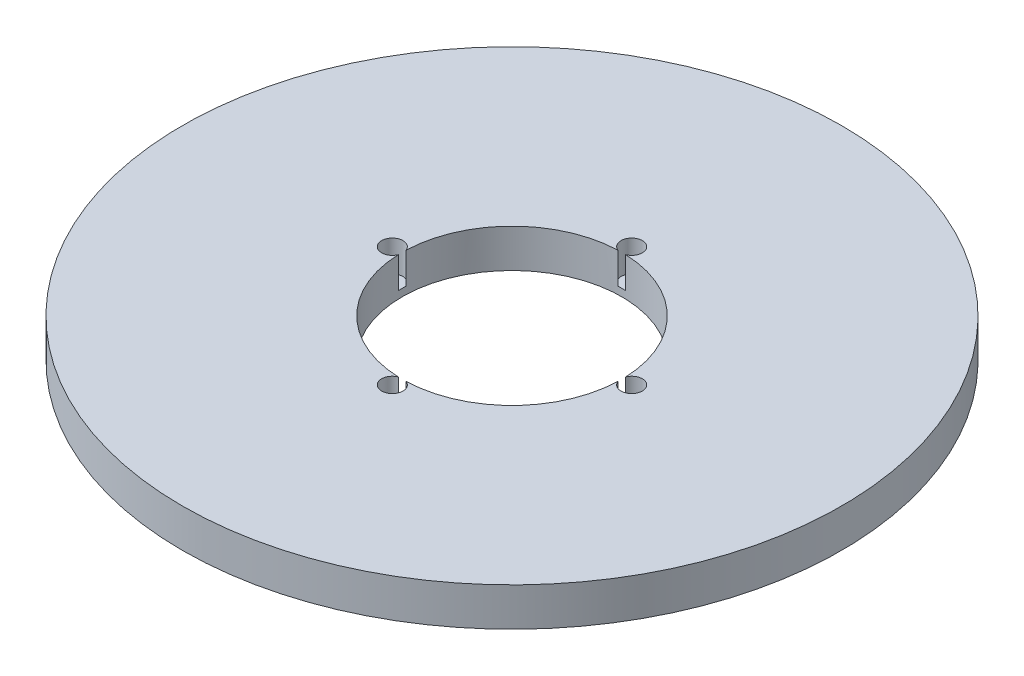
ISO-10303-21;
HEADER;
FILE_DESCRIPTION(('STEP AP214'),'2;1');
FILE_NAME('part.step','',(''),(''),'','','');
FILE_SCHEMA(('AUTOMOTIVE_DESIGN { 1 0 10303 214 1 1 1 1 }'));
ENDSEC;
DATA;
#1=APPLICATION_CONTEXT('core data for automotive mechanical design processes');
#2=APPLICATION_PROTOCOL_DEFINITION('international standard','automotive_design',2000,#1);
#3=PRODUCT_CONTEXT('',#1,'mechanical');
#4=PRODUCT('Part','Part','',(#3));
#5=PRODUCT_RELATED_PRODUCT_CATEGORY('part','',(#4));
#6=PRODUCT_DEFINITION_FORMATION('','',#4);
#7=PRODUCT_DEFINITION_CONTEXT('part definition',#1,'design');
#8=PRODUCT_DEFINITION('design','',#6,#7);
#9=PRODUCT_DEFINITION_SHAPE('','',#8);
#10=(LENGTH_UNIT() NAMED_UNIT(*) SI_UNIT(.MILLI.,.METRE.));
#11=(NAMED_UNIT(*) PLANE_ANGLE_UNIT() SI_UNIT($,.RADIAN.));
#12=(NAMED_UNIT(*) SI_UNIT($,.STERADIAN.) SOLID_ANGLE_UNIT());
#13=UNCERTAINTY_MEASURE_WITH_UNIT(LENGTH_MEASURE(1.E-05),#10,'distance_accuracy_value','');
#14=(GEOMETRIC_REPRESENTATION_CONTEXT(3) GLOBAL_UNCERTAINTY_ASSIGNED_CONTEXT((#13)) GLOBAL_UNIT_ASSIGNED_CONTEXT((#10,
#11,#12)) REPRESENTATION_CONTEXT('',''));
#15=CARTESIAN_POINT('',(0.,0.,0.));
#16=DIRECTION('',(0.,0.,1.));
#17=DIRECTION('',(1.,0.,0.));
#18=AXIS2_PLACEMENT_3D('',#15,#16,#17);
#19=CARTESIAN_POINT('',(0.,7.,0.));
#20=DIRECTION('',(0.,-1.,0.));
#21=DIRECTION('',(0.,0.,-1.));
#22=AXIS2_PLACEMENT_3D('',#19,#20,#21);
#23=CYLINDRICAL_SURFACE('',#22,60.);
#24=CARTESIAN_POINT('',(0.,7.,0.));
#25=DIRECTION('',(0.,1.,0.));
#26=DIRECTION('',(0.,0.,1.));
#27=AXIS2_PLACEMENT_3D('',#24,#25,#26);
#28=CIRCLE('',#27,60.);
#29=CARTESIAN_POINT('',(0.,7.,60.));
#30=VERTEX_POINT('',#29);
#31=EDGE_CURVE('E145',#30,#30,#28,.T.);
#32=ORIENTED_EDGE('',*,*,#31,.F.);
#33=EDGE_LOOP('',(#32));
#34=FACE_BOUND('',#33,.T.);
#35=CARTESIAN_POINT('',(0.,0.,0.));
#36=DIRECTION('',(0.,1.,0.));
#37=DIRECTION('',(0.,0.,1.));
#38=AXIS2_PLACEMENT_3D('',#35,#36,#37);
#39=CIRCLE('',#38,60.);
#40=CARTESIAN_POINT('',(0.,0.,60.));
#41=VERTEX_POINT('',#40);
#42=EDGE_CURVE('E143',#41,#41,#39,.T.);
#43=ORIENTED_EDGE('',*,*,#42,.T.);
#44=EDGE_LOOP('',(#43));
#45=FACE_BOUND('',#44,.T.);
#46=ADVANCED_FACE('F39',(#34,#45),#23,.T.);
#47=CARTESIAN_POINT('',(0.,7.,0.));
#48=DIRECTION('',(0.,1.,0.));
#49=DIRECTION('',(0.,0.,1.));
#50=AXIS2_PLACEMENT_3D('',#47,#48,#49);
#51=PLANE('',#50);
#52=CARTESIAN_POINT('',(0.,7.,21.7902012223669));
#53=DIRECTION('',(0.,1.,0.));
#54=DIRECTION('',(1.,0.,0.));
#55=AXIS2_PLACEMENT_3D('',#52,#53,#54);
#56=CIRCLE('',#55,1.9382259181155);
#57=CARTESIAN_POINT('',(-0.71161572601711,7.,19.9873360670822));
#58=VERTEX_POINT('',#57);
#59=CARTESIAN_POINT('',(0.711615726017248,7.,19.9873360670822));
#60=VERTEX_POINT('',#59);
#61=EDGE_CURVE('E152',#58,#60,#56,.T.);
#62=ORIENTED_EDGE('',*,*,#61,.F.);
#63=CARTESIAN_POINT('',(0.,7.,0.));
#64=DIRECTION('',(0.,1.,0.));
#65=DIRECTION('',(0.,0.,1.));
#66=AXIS2_PLACEMENT_3D('',#63,#64,#65);
#67=CIRCLE('',#66,20.);
#68=CARTESIAN_POINT('',(-19.9873360670822,7.,0.711615726017179));
#69=VERTEX_POINT('',#68);
#70=EDGE_CURVE('E133',#69,#58,#67,.T.);
#71=ORIENTED_EDGE('',*,*,#70,.F.);
#72=CARTESIAN_POINT('',(-21.7902012223669,7.,0.));
#73=DIRECTION('',(0.,1.,0.));
#74=DIRECTION('',(0.,0.,1.));
#75=AXIS2_PLACEMENT_3D('',#72,#73,#74);
#76=CIRCLE('',#75,1.9382259181155);
#77=CARTESIAN_POINT('',(-19.9873360670822,7.,-0.711615726017179));
#78=VERTEX_POINT('',#77);
#79=EDGE_CURVE('E128',#78,#69,#76,.T.);
#80=ORIENTED_EDGE('',*,*,#79,.F.);
#81=CARTESIAN_POINT('',(-0.711615726017389,7.,-19.9873360670822));
#82=VERTEX_POINT('',#81);
#83=EDGE_CURVE('E121',#82,#78,#67,.T.);
#84=ORIENTED_EDGE('',*,*,#83,.F.);
#85=CARTESIAN_POINT('',(-2.28240242812593E-13,7.,-21.7902012223669));
#86=DIRECTION('',(0.,1.,0.));
#87=DIRECTION('',(-1.,0.,0.));
#88=AXIS2_PLACEMENT_3D('',#85,#86,#87);
#89=CIRCLE('',#88,1.9382259181155);
#90=CARTESIAN_POINT('',(0.71161572601697,7.,-19.9873360670822));
#91=VERTEX_POINT('',#90);
#92=EDGE_CURVE('E105',#91,#82,#89,.T.);
#93=ORIENTED_EDGE('',*,*,#92,.F.);
#94=CARTESIAN_POINT('',(19.9873360670822,7.,-0.711615726017179));
#95=VERTEX_POINT('',#94);
#96=EDGE_CURVE('E131',#95,#91,#67,.T.);
#97=ORIENTED_EDGE('',*,*,#96,.F.);
#98=CARTESIAN_POINT('',(21.7902012223669,7.,0.));
#99=DIRECTION('',(0.,1.,0.));
#100=DIRECTION('',(0.,0.,-1.));
#101=AXIS2_PLACEMENT_3D('',#98,#99,#100);
#102=CIRCLE('',#101,1.9382259181155);
#103=CARTESIAN_POINT('',(19.9873360670822,7.,0.711615726017179));
#104=VERTEX_POINT('',#103);
#105=EDGE_CURVE('E154',#104,#95,#102,.T.);
#106=ORIENTED_EDGE('',*,*,#105,.F.);
#107=EDGE_CURVE('E134',#60,#104,#67,.T.);
#108=ORIENTED_EDGE('',*,*,#107,.F.);
#109=EDGE_LOOP('',(#62,#71,#80,#84,#93,#97,#106,#108));
#110=FACE_BOUND('',#109,.T.);
#111=ORIENTED_EDGE('',*,*,#31,.T.);
#112=EDGE_LOOP('',(#111));
#113=FACE_BOUND('',#112,.T.);
#114=ADVANCED_FACE('F130',(#110,#113),#51,.T.);
#115=CARTESIAN_POINT('',(0.,0.,0.));
#116=DIRECTION('',(0.,1.,0.));
#117=DIRECTION('',(0.,0.,1.));
#118=AXIS2_PLACEMENT_3D('',#115,#116,#117);
#119=PLANE('',#118);
#120=CARTESIAN_POINT('',(0.,0.,0.));
#121=DIRECTION('',(0.,1.,0.));
#122=DIRECTION('',(0.,0.,1.));
#123=AXIS2_PLACEMENT_3D('',#120,#121,#122);
#124=CIRCLE('',#123,20.);
#125=CARTESIAN_POINT('',(0.,0.,20.));
#126=VERTEX_POINT('',#125);
#127=EDGE_CURVE('E135',#126,#126,#124,.T.);
#128=ORIENTED_EDGE('',*,*,#127,.T.);
#129=EDGE_LOOP('',(#128));
#130=FACE_BOUND('',#129,.T.);
#131=ORIENTED_EDGE('',*,*,#42,.F.);
#132=EDGE_LOOP('',(#131));
#133=FACE_BOUND('',#132,.T.);
#134=ADVANCED_FACE('F195',(#130,#133),#119,.F.);
#135=CARTESIAN_POINT('',(0.,7.,0.));
#136=DIRECTION('',(0.,-1.,0.));
#137=DIRECTION('',(0.,0.,-1.));
#138=AXIS2_PLACEMENT_3D('',#135,#136,#137);
#139=CYLINDRICAL_SURFACE('',#138,20.);
#140=DIRECTION('',(0.,1.,0.));
#141=VECTOR('',#140,1.);
#142=CARTESIAN_POINT('',(-0.71161572601712,4.16236323519653,19.9873360670822));
#143=LINE('',#142,#141);
#144=CARTESIAN_POINT('',(-0.71161572601711,1.32472647039306,19.9873360670822));
#145=VERTEX_POINT('',#144);
#146=EDGE_CURVE('E11',#145,#58,#143,.T.);
#147=ORIENTED_EDGE('',*,*,#146,.F.);
#148=CARTESIAN_POINT('',(0.,1.32472647039306,0.));
#149=DIRECTION('',(0.,1.,0.));
#150=DIRECTION('',(0.,0.,1.));
#151=AXIS2_PLACEMENT_3D('',#148,#149,#150);
#152=CIRCLE('',#151,20.);
#153=CARTESIAN_POINT('',(0.711615726017248,1.32472647039306,19.9873360670822));
#154=VERTEX_POINT('',#153);
#155=EDGE_CURVE('E169',#145,#154,#152,.T.);
#156=ORIENTED_EDGE('',*,*,#155,.T.);
#157=DIRECTION('',(0.,1.,0.));
#158=VECTOR('',#157,1.);
#159=CARTESIAN_POINT('',(0.711615726017259,4.16236323519653,19.9873360670822));
#160=LINE('',#159,#158);
#161=EDGE_CURVE('E46',#60,#154,#160,.F.);
#162=ORIENTED_EDGE('',*,*,#161,.F.);
#163=ORIENTED_EDGE('',*,*,#107,.T.);
#164=DIRECTION('',(0.,1.,0.));
#165=VECTOR('',#164,1.);
#166=CARTESIAN_POINT('',(19.9873360670822,4.16236323519653,0.711615726017189));
#167=LINE('',#166,#165);
#168=CARTESIAN_POINT('',(19.9873360670822,1.32472647039306,0.711615726017179));
#169=VERTEX_POINT('',#168);
#170=EDGE_CURVE('E151',#169,#104,#167,.T.);
#171=ORIENTED_EDGE('',*,*,#170,.F.);
#172=CARTESIAN_POINT('',(0.,1.32472647039306,0.));
#173=DIRECTION('',(0.,1.,0.));
#174=DIRECTION('',(0.,0.,1.));
#175=AXIS2_PLACEMENT_3D('',#172,#173,#174);
#176=CIRCLE('',#175,20.);
#177=CARTESIAN_POINT('',(19.9873360670822,1.32472647039306,-0.711615726017179));
#178=VERTEX_POINT('',#177);
#179=EDGE_CURVE('E173',#169,#178,#176,.T.);
#180=ORIENTED_EDGE('',*,*,#179,.T.);
#181=DIRECTION('',(0.,1.,0.));
#182=VECTOR('',#181,1.);
#183=CARTESIAN_POINT('',(19.9873360670822,4.16236323519653,-0.711615726017189));
#184=LINE('',#183,#182);
#185=EDGE_CURVE('E168',#95,#178,#184,.F.);
#186=ORIENTED_EDGE('',*,*,#185,.F.);
#187=ORIENTED_EDGE('',*,*,#96,.T.);
#188=DIRECTION('',(0.,1.,0.));
#189=VECTOR('',#188,1.);
#190=CARTESIAN_POINT('',(0.71161572601698,4.16236323519653,-19.9873360670822));
#191=LINE('',#190,#189);
#192=CARTESIAN_POINT('',(0.71161572601697,1.32472647039306,-19.9873360670822));
#193=VERTEX_POINT('',#192);
#194=EDGE_CURVE('E108',#193,#91,#191,.T.);
#195=ORIENTED_EDGE('',*,*,#194,.F.);
#196=CARTESIAN_POINT('',(0.,1.32472647039306,0.));
#197=DIRECTION('',(0.,1.,0.));
#198=DIRECTION('',(0.,0.,1.));
#199=AXIS2_PLACEMENT_3D('',#196,#197,#198);
#200=CIRCLE('',#199,20.);
#201=CARTESIAN_POINT('',(-0.711615726017389,1.32472647039306,-19.9873360670822));
#202=VERTEX_POINT('',#201);
#203=EDGE_CURVE('E122',#193,#202,#200,.T.);
#204=ORIENTED_EDGE('',*,*,#203,.T.);
#205=DIRECTION('',(0.,1.,0.));
#206=VECTOR('',#205,1.);
#207=CARTESIAN_POINT('',(-0.711615726017399,4.16236323519653,-19.9873360670822));
#208=LINE('',#207,#206);
#209=EDGE_CURVE('E106',#82,#202,#208,.F.);
#210=ORIENTED_EDGE('',*,*,#209,.F.);
#211=ORIENTED_EDGE('',*,*,#83,.T.);
#212=DIRECTION('',(0.,1.,0.));
#213=VECTOR('',#212,1.);
#214=CARTESIAN_POINT('',(-19.9873360670822,4.16236323519653,-0.711615726017189));
#215=LINE('',#214,#213);
#216=CARTESIAN_POINT('',(-19.9873360670822,1.32472647039306,-0.711615726017179));
#217=VERTEX_POINT('',#216);
#218=EDGE_CURVE('E177',#217,#78,#215,.T.);
#219=ORIENTED_EDGE('',*,*,#218,.F.);
#220=CARTESIAN_POINT('',(0.,1.32472647039306,0.));
#221=DIRECTION('',(0.,1.,0.));
#222=DIRECTION('',(0.,0.,1.));
#223=AXIS2_PLACEMENT_3D('',#220,#221,#222);
#224=CIRCLE('',#223,20.);
#225=CARTESIAN_POINT('',(-19.9873360670822,1.32472647039306,0.711615726017179));
#226=VERTEX_POINT('',#225);
#227=EDGE_CURVE('E185',#217,#226,#224,.T.);
#228=ORIENTED_EDGE('',*,*,#227,.T.);
#229=DIRECTION('',(0.,1.,0.));
#230=VECTOR('',#229,1.);
#231=CARTESIAN_POINT('',(-19.9873360670822,4.16236323519653,0.711615726017189));
#232=LINE('',#231,#230);
#233=EDGE_CURVE('E179',#69,#226,#232,.F.);
#234=ORIENTED_EDGE('',*,*,#233,.F.);
#235=ORIENTED_EDGE('',*,*,#70,.T.);
#236=EDGE_LOOP('',(#147,#156,#162,#163,#171,#180,#186,#187,#195,#204,#210,#211,#219,#228,#234,#235));
#237=FACE_BOUND('',#236,.T.);
#238=ORIENTED_EDGE('',*,*,#127,.F.);
#239=EDGE_LOOP('',(#238));
#240=FACE_BOUND('',#239,.T.);
#241=ADVANCED_FACE('F117',(#237,#240),#139,.F.);
#242=CARTESIAN_POINT('',(-21.7902012223669,1.32472647039306,0.));
#243=DIRECTION('',(0.,1.,0.));
#244=DIRECTION('',(0.,0.,1.));
#245=AXIS2_PLACEMENT_3D('',#242,#243,#244);
#246=CYLINDRICAL_SURFACE('',#245,1.9382259181155);
#247=ORIENTED_EDGE('',*,*,#218,.T.);
#248=ORIENTED_EDGE('',*,*,#79,.T.);
#249=ORIENTED_EDGE('',*,*,#233,.T.);
#250=CARTESIAN_POINT('',(-21.7902012223669,1.32472647039306,0.));
#251=DIRECTION('',(0.,1.,0.));
#252=DIRECTION('',(0.,0.,1.));
#253=AXIS2_PLACEMENT_3D('',#250,#251,#252);
#254=CIRCLE('',#253,1.9382259181155);
#255=EDGE_CURVE('E140',#217,#226,#254,.T.);
#256=ORIENTED_EDGE('',*,*,#255,.F.);
#257=EDGE_LOOP('',(#247,#248,#249,#256));
#258=FACE_BOUND('',#257,.T.);
#259=ADVANCED_FACE('F200',(#258),#246,.F.);
#260=CARTESIAN_POINT('',(-21.7902012223669,1.32472647039306,0.));
#261=DIRECTION('',(0.,1.,0.));
#262=DIRECTION('',(0.,0.,1.));
#263=AXIS2_PLACEMENT_3D('',#260,#261,#262);
#264=PLANE('',#263);
#265=ORIENTED_EDGE('',*,*,#255,.T.);
#266=ORIENTED_EDGE('',*,*,#227,.F.);
#267=EDGE_LOOP('',(#265,#266));
#268=FACE_BOUND('',#267,.T.);
#269=ADVANCED_FACE('F202',(#268),#264,.T.);
#270=CARTESIAN_POINT('',(-2.28240242812593E-13,1.32472647039306,-21.7902012223669));
#271=DIRECTION('',(0.,1.,0.));
#272=DIRECTION('',(0.,0.,1.));
#273=AXIS2_PLACEMENT_3D('',#270,#271,#272);
#274=CYLINDRICAL_SURFACE('',#273,1.9382259181155);
#275=ORIENTED_EDGE('',*,*,#194,.T.);
#276=ORIENTED_EDGE('',*,*,#92,.T.);
#277=ORIENTED_EDGE('',*,*,#209,.T.);
#278=CARTESIAN_POINT('',(-2.28240242812593E-13,1.32472647039306,-21.7902012223669));
#279=DIRECTION('',(0.,1.,0.));
#280=DIRECTION('',(-1.,0.,0.));
#281=AXIS2_PLACEMENT_3D('',#278,#279,#280);
#282=CIRCLE('',#281,1.9382259181155);
#283=EDGE_CURVE('E111',#193,#202,#282,.T.);
#284=ORIENTED_EDGE('',*,*,#283,.F.);
#285=EDGE_LOOP('',(#275,#276,#277,#284));
#286=FACE_BOUND('',#285,.T.);
#287=ADVANCED_FACE('F102',(#286),#274,.F.);
#288=CARTESIAN_POINT('',(-2.28240242812593E-13,1.32472647039306,-21.7902012223669));
#289=DIRECTION('',(0.,1.,0.));
#290=DIRECTION('',(-1.,0.,0.));
#291=AXIS2_PLACEMENT_3D('',#288,#289,#290);
#292=PLANE('',#291);
#293=ORIENTED_EDGE('',*,*,#283,.T.);
#294=ORIENTED_EDGE('',*,*,#203,.F.);
#295=EDGE_LOOP('',(#293,#294));
#296=FACE_BOUND('',#295,.T.);
#297=ADVANCED_FACE('F211',(#296),#292,.T.);
#298=CARTESIAN_POINT('',(21.7902012223669,1.32472647039306,0.));
#299=DIRECTION('',(0.,1.,0.));
#300=DIRECTION('',(0.,0.,1.));
#301=AXIS2_PLACEMENT_3D('',#298,#299,#300);
#302=CYLINDRICAL_SURFACE('',#301,1.9382259181155);
#303=ORIENTED_EDGE('',*,*,#170,.T.);
#304=ORIENTED_EDGE('',*,*,#105,.T.);
#305=ORIENTED_EDGE('',*,*,#185,.T.);
#306=CARTESIAN_POINT('',(21.7902012223669,1.32472647039306,0.));
#307=DIRECTION('',(0.,1.,0.));
#308=DIRECTION('',(0.,0.,-1.));
#309=AXIS2_PLACEMENT_3D('',#306,#307,#308);
#310=CIRCLE('',#309,1.9382259181155);
#311=EDGE_CURVE('E56',#169,#178,#310,.T.);
#312=ORIENTED_EDGE('',*,*,#311,.F.);
#313=EDGE_LOOP('',(#303,#304,#305,#312));
#314=FACE_BOUND('',#313,.T.);
#315=ADVANCED_FACE('F212',(#314),#302,.F.);
#316=CARTESIAN_POINT('',(21.7902012223669,1.32472647039306,0.));
#317=DIRECTION('',(0.,1.,0.));
#318=DIRECTION('',(0.,0.,-1.));
#319=AXIS2_PLACEMENT_3D('',#316,#317,#318);
#320=PLANE('',#319);
#321=ORIENTED_EDGE('',*,*,#311,.T.);
#322=ORIENTED_EDGE('',*,*,#179,.F.);
#323=EDGE_LOOP('',(#321,#322));
#324=FACE_BOUND('',#323,.T.);
#325=ADVANCED_FACE('F217',(#324),#320,.T.);
#326=CARTESIAN_POINT('',(0.,1.32472647039306,21.7902012223669));
#327=DIRECTION('',(0.,1.,0.));
#328=DIRECTION('',(0.,0.,1.));
#329=AXIS2_PLACEMENT_3D('',#326,#327,#328);
#330=CYLINDRICAL_SURFACE('',#329,1.9382259181155);
#331=ORIENTED_EDGE('',*,*,#146,.T.);
#332=ORIENTED_EDGE('',*,*,#61,.T.);
#333=ORIENTED_EDGE('',*,*,#161,.T.);
#334=CARTESIAN_POINT('',(0.,1.32472647039306,21.7902012223669));
#335=DIRECTION('',(0.,1.,0.));
#336=DIRECTION('',(1.,0.,0.));
#337=AXIS2_PLACEMENT_3D('',#334,#335,#336);
#338=CIRCLE('',#337,1.9382259181155);
#339=EDGE_CURVE('E55',#145,#154,#338,.T.);
#340=ORIENTED_EDGE('',*,*,#339,.F.);
#341=EDGE_LOOP('',(#331,#332,#333,#340));
#342=FACE_BOUND('',#341,.T.);
#343=ADVANCED_FACE('F170',(#342),#330,.F.);
#344=CARTESIAN_POINT('',(0.,1.32472647039306,21.7902012223669));
#345=DIRECTION('',(0.,1.,0.));
#346=DIRECTION('',(1.,0.,0.));
#347=AXIS2_PLACEMENT_3D('',#344,#345,#346);
#348=PLANE('',#347);
#349=ORIENTED_EDGE('',*,*,#339,.T.);
#350=ORIENTED_EDGE('',*,*,#155,.F.);
#351=EDGE_LOOP('',(#349,#350));
#352=FACE_BOUND('',#351,.T.);
#353=ADVANCED_FACE('F224',(#352),#348,.T.);
#354=CLOSED_SHELL('',(#46,#114,#134,#241,#259,#269,#287,#297,#315,#325,#343,#353));
#355=MANIFOLD_SOLID_BREP('B2',#354);
#356=ADVANCED_BREP_SHAPE_REPRESENTATION('',(#18,#355),#14);
#357=SHAPE_DEFINITION_REPRESENTATION(#9,#356);
ENDSEC;
END-ISO-10303-21;
